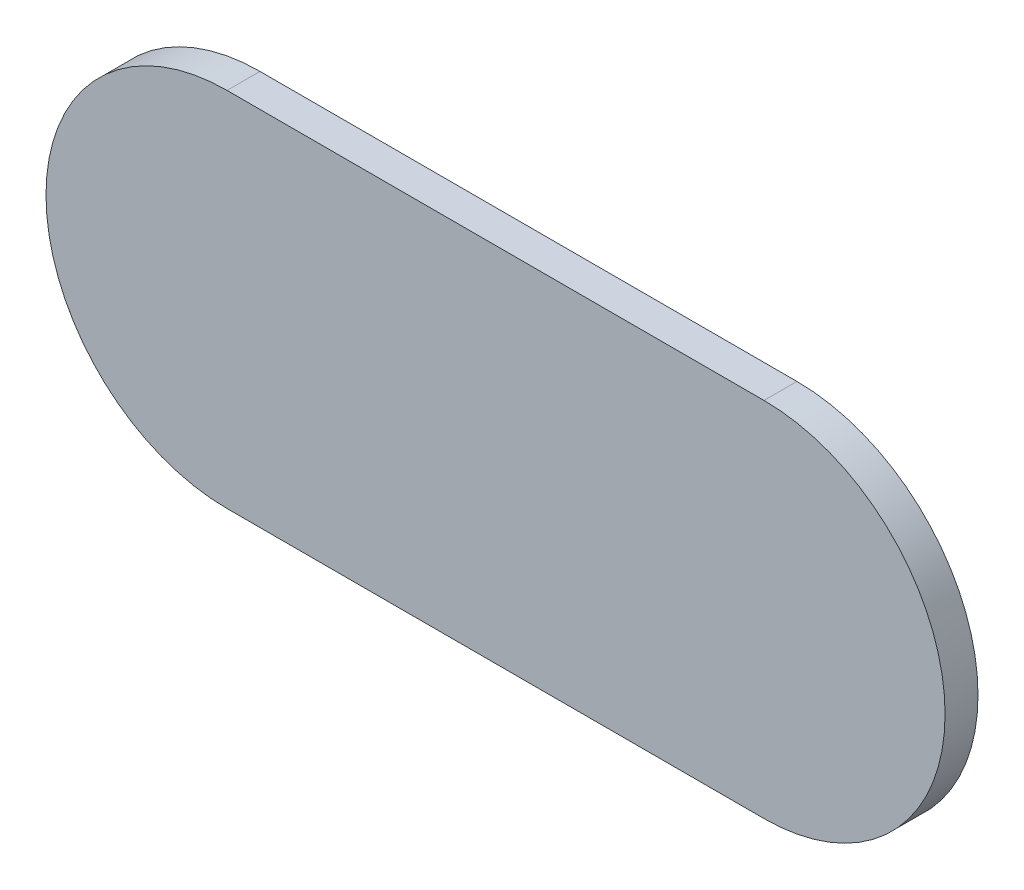
ISO-10303-21;
HEADER;
FILE_DESCRIPTION(('STEP AP214'),'2;1');
FILE_NAME('part.step','',(''),(''),'','','');
FILE_SCHEMA(('AUTOMOTIVE_DESIGN { 1 0 10303 214 1 1 1 1 }'));
ENDSEC;
DATA;
#1=APPLICATION_CONTEXT('core data for automotive mechanical design processes');
#2=APPLICATION_PROTOCOL_DEFINITION('international standard','automotive_design',2000,#1);
#3=PRODUCT_CONTEXT('',#1,'mechanical');
#4=PRODUCT('Part','Part','',(#3));
#5=PRODUCT_RELATED_PRODUCT_CATEGORY('part','',(#4));
#6=PRODUCT_DEFINITION_FORMATION('','',#4);
#7=PRODUCT_DEFINITION_CONTEXT('part definition',#1,'design');
#8=PRODUCT_DEFINITION('design','',#6,#7);
#9=PRODUCT_DEFINITION_SHAPE('','',#8);
#10=(LENGTH_UNIT() NAMED_UNIT(*) SI_UNIT(.MILLI.,.METRE.));
#11=(NAMED_UNIT(*) PLANE_ANGLE_UNIT() SI_UNIT($,.RADIAN.));
#12=(NAMED_UNIT(*) SI_UNIT($,.STERADIAN.) SOLID_ANGLE_UNIT());
#13=UNCERTAINTY_MEASURE_WITH_UNIT(LENGTH_MEASURE(1.E-05),#10,'distance_accuracy_value','');
#14=(GEOMETRIC_REPRESENTATION_CONTEXT(3) GLOBAL_UNCERTAINTY_ASSIGNED_CONTEXT((#13)) GLOBAL_UNIT_ASSIGNED_CONTEXT((#10,
#11,#12)) REPRESENTATION_CONTEXT('',''));
#15=CARTESIAN_POINT('',(0.,0.,0.));
#16=DIRECTION('',(0.,0.,1.));
#17=DIRECTION('',(1.,0.,0.));
#18=AXIS2_PLACEMENT_3D('',#15,#16,#17);
#19=CARTESIAN_POINT('',(-46.5860721372025,-5.02761621810885,0.5));
#20=DIRECTION('',(0.,0.,-1.));
#21=DIRECTION('',(-1.,0.,0.));
#22=AXIS2_PLACEMENT_3D('',#19,#20,#21);
#23=CYLINDRICAL_SURFACE('',#22,2.75);
#24=CARTESIAN_POINT('',(-46.5860721372025,-5.02761621810885,0.));
#25=DIRECTION('',(0.,0.,1.));
#26=DIRECTION('',(1.,0.,0.));
#27=AXIS2_PLACEMENT_3D('',#24,#25,#26);
#28=CIRCLE('',#27,2.75);
#29=CARTESIAN_POINT('',(-46.5860721372025,-2.27761621810885,0.));
#30=VERTEX_POINT('',#29);
#31=CARTESIAN_POINT('',(-46.5860721372025,-7.77761621810885,0.));
#32=VERTEX_POINT('',#31);
#33=EDGE_CURVE('E97',#30,#32,#28,.T.);
#34=ORIENTED_EDGE('',*,*,#33,.T.);
#35=DIRECTION('',(0.,0.,-1.));
#36=VECTOR('',#35,1.);
#37=CARTESIAN_POINT('',(-46.5860721372025,-7.77761621810885,0.5));
#38=LINE('',#37,#36);
#39=CARTESIAN_POINT('',(-46.5860721372025,-7.77761621810885,0.5));
#40=VERTEX_POINT('',#39);
#41=EDGE_CURVE('E11',#40,#32,#38,.T.);
#42=ORIENTED_EDGE('',*,*,#41,.F.);
#43=CARTESIAN_POINT('',(-46.5860721372025,-5.02761621810885,0.5));
#44=DIRECTION('',(0.,0.,1.));
#45=DIRECTION('',(1.,0.,0.));
#46=AXIS2_PLACEMENT_3D('',#43,#44,#45);
#47=CIRCLE('',#46,2.75);
#48=CARTESIAN_POINT('',(-46.5860721372025,-2.27761621810885,0.5));
#49=VERTEX_POINT('',#48);
#50=EDGE_CURVE('E85',#49,#40,#47,.T.);
#51=ORIENTED_EDGE('',*,*,#50,.F.);
#52=DIRECTION('',(0.,0.,-1.));
#53=VECTOR('',#52,1.);
#54=CARTESIAN_POINT('',(-46.5860721372025,-2.27761621810885,0.5));
#55=LINE('',#54,#53);
#56=EDGE_CURVE('E93',#49,#30,#55,.T.);
#57=ORIENTED_EDGE('',*,*,#56,.T.);
#58=EDGE_LOOP('',(#34,#42,#51,#57));
#59=FACE_BOUND('',#58,.T.);
#60=ADVANCED_FACE('F34',(#59),#23,.T.);
#61=CARTESIAN_POINT('',(-46.5860721372025,-7.77761621810885,0.5));
#62=DIRECTION('',(0.,1.,0.));
#63=DIRECTION('',(0.,0.,1.));
#64=AXIS2_PLACEMENT_3D('',#61,#62,#63);
#65=PLANE('',#64);
#66=DIRECTION('',(1.,0.,0.));
#67=VECTOR('',#66,1.);
#68=CARTESIAN_POINT('',(-46.5860721372025,-7.77761621810885,0.));
#69=LINE('',#68,#67);
#70=CARTESIAN_POINT('',(-38.4307686848284,-7.77761621810885,0.));
#71=VERTEX_POINT('',#70);
#72=EDGE_CURVE('E89',#32,#71,#69,.T.);
#73=ORIENTED_EDGE('',*,*,#72,.T.);
#74=DIRECTION('',(0.,0.,-1.));
#75=VECTOR('',#74,1.);
#76=CARTESIAN_POINT('',(-38.4307686848284,-7.77761621810885,0.5));
#77=LINE('',#76,#75);
#78=CARTESIAN_POINT('',(-38.4307686848284,-7.77761621810885,0.5));
#79=VERTEX_POINT('',#78);
#80=EDGE_CURVE('E42',#79,#71,#77,.T.);
#81=ORIENTED_EDGE('',*,*,#80,.F.);
#82=DIRECTION('',(1.,0.,0.));
#83=VECTOR('',#82,1.);
#84=CARTESIAN_POINT('',(-46.5860721372025,-7.77761621810885,0.5));
#85=LINE('',#84,#83);
#86=EDGE_CURVE('E80',#40,#79,#85,.T.);
#87=ORIENTED_EDGE('',*,*,#86,.F.);
#88=ORIENTED_EDGE('',*,*,#41,.T.);
#89=EDGE_LOOP('',(#73,#81,#87,#88));
#90=FACE_BOUND('',#89,.T.);
#91=ADVANCED_FACE('F88',(#90),#65,.F.);
#92=CARTESIAN_POINT('',(-38.4307686848284,-5.02761621810885,0.5));
#93=DIRECTION('',(0.,0.,-1.));
#94=DIRECTION('',(-1.,0.,0.));
#95=AXIS2_PLACEMENT_3D('',#92,#93,#94);
#96=CYLINDRICAL_SURFACE('',#95,2.75);
#97=CARTESIAN_POINT('',(-38.4307686848284,-5.02761621810885,0.));
#98=DIRECTION('',(0.,0.,1.));
#99=DIRECTION('',(1.,0.,0.));
#100=AXIS2_PLACEMENT_3D('',#97,#98,#99);
#101=CIRCLE('',#100,2.75);
#102=CARTESIAN_POINT('',(-38.4307686848284,-2.27761621810885,0.));
#103=VERTEX_POINT('',#102);
#104=EDGE_CURVE('E67',#71,#103,#101,.T.);
#105=ORIENTED_EDGE('',*,*,#104,.T.);
#106=DIRECTION('',(0.,0.,-1.));
#107=VECTOR('',#106,1.);
#108=CARTESIAN_POINT('',(-38.4307686848284,-2.27761621810885,0.5));
#109=LINE('',#108,#107);
#110=CARTESIAN_POINT('',(-38.4307686848284,-2.27761621810885,0.5));
#111=VERTEX_POINT('',#110);
#112=EDGE_CURVE('E90',#111,#103,#109,.T.);
#113=ORIENTED_EDGE('',*,*,#112,.F.);
#114=CARTESIAN_POINT('',(-38.4307686848284,-5.02761621810885,0.5));
#115=DIRECTION('',(0.,0.,1.));
#116=DIRECTION('',(1.,0.,0.));
#117=AXIS2_PLACEMENT_3D('',#114,#115,#116);
#118=CIRCLE('',#117,2.75);
#119=EDGE_CURVE('E83',#79,#111,#118,.T.);
#120=ORIENTED_EDGE('',*,*,#119,.F.);
#121=ORIENTED_EDGE('',*,*,#80,.T.);
#122=EDGE_LOOP('',(#105,#113,#120,#121));
#123=FACE_BOUND('',#122,.T.);
#124=ADVANCED_FACE('F91',(#123),#96,.T.);
#125=CARTESIAN_POINT('',(-46.5860721372025,-2.27761621810885,0.5));
#126=DIRECTION('',(0.,-1.,0.));
#127=DIRECTION('',(0.,0.,-1.));
#128=AXIS2_PLACEMENT_3D('',#125,#126,#127);
#129=PLANE('',#128);
#130=DIRECTION('',(-1.,0.,0.));
#131=VECTOR('',#130,1.);
#132=CARTESIAN_POINT('',(-46.5860721372025,-2.27761621810885,0.));
#133=LINE('',#132,#131);
#134=EDGE_CURVE('E73',#103,#30,#133,.T.);
#135=ORIENTED_EDGE('',*,*,#134,.T.);
#136=ORIENTED_EDGE('',*,*,#56,.F.);
#137=DIRECTION('',(-1.,0.,0.));
#138=VECTOR('',#137,1.);
#139=CARTESIAN_POINT('',(-46.5860721372025,-2.27761621810885,0.5));
#140=LINE('',#139,#138);
#141=EDGE_CURVE('E50',#111,#49,#140,.T.);
#142=ORIENTED_EDGE('',*,*,#141,.F.);
#143=ORIENTED_EDGE('',*,*,#112,.T.);
#144=EDGE_LOOP('',(#135,#136,#142,#143));
#145=FACE_BOUND('',#144,.T.);
#146=ADVANCED_FACE('F104',(#145),#129,.F.);
#147=CARTESIAN_POINT('',(-46.5860721372025,-5.02761621810885,0.5));
#148=DIRECTION('',(0.,0.,1.));
#149=DIRECTION('',(1.,0.,0.));
#150=AXIS2_PLACEMENT_3D('',#147,#148,#149);
#151=PLANE('',#150);
#152=ORIENTED_EDGE('',*,*,#50,.T.);
#153=ORIENTED_EDGE('',*,*,#86,.T.);
#154=ORIENTED_EDGE('',*,*,#119,.T.);
#155=ORIENTED_EDGE('',*,*,#141,.T.);
#156=EDGE_LOOP('',(#152,#153,#154,#155));
#157=FACE_BOUND('',#156,.T.);
#158=ADVANCED_FACE('F81',(#157),#151,.T.);
#159=CARTESIAN_POINT('',(-46.5860721372025,-5.02761621810885,0.));
#160=DIRECTION('',(0.,0.,1.));
#161=DIRECTION('',(1.,0.,0.));
#162=AXIS2_PLACEMENT_3D('',#159,#160,#161);
#163=PLANE('',#162);
#164=ORIENTED_EDGE('',*,*,#33,.F.);
#165=ORIENTED_EDGE('',*,*,#134,.F.);
#166=ORIENTED_EDGE('',*,*,#104,.F.);
#167=ORIENTED_EDGE('',*,*,#72,.F.);
#168=EDGE_LOOP('',(#164,#165,#166,#167));
#169=FACE_BOUND('',#168,.T.);
#170=ADVANCED_FACE('F107',(#169),#163,.F.);
#171=CLOSED_SHELL('',(#60,#91,#124,#146,#158,#170));
#172=MANIFOLD_SOLID_BREP('B2',#171);
#173=ADVANCED_BREP_SHAPE_REPRESENTATION('',(#18,#172),#14);
#174=SHAPE_DEFINITION_REPRESENTATION(#9,#173);
ENDSEC;
END-ISO-10303-21;
